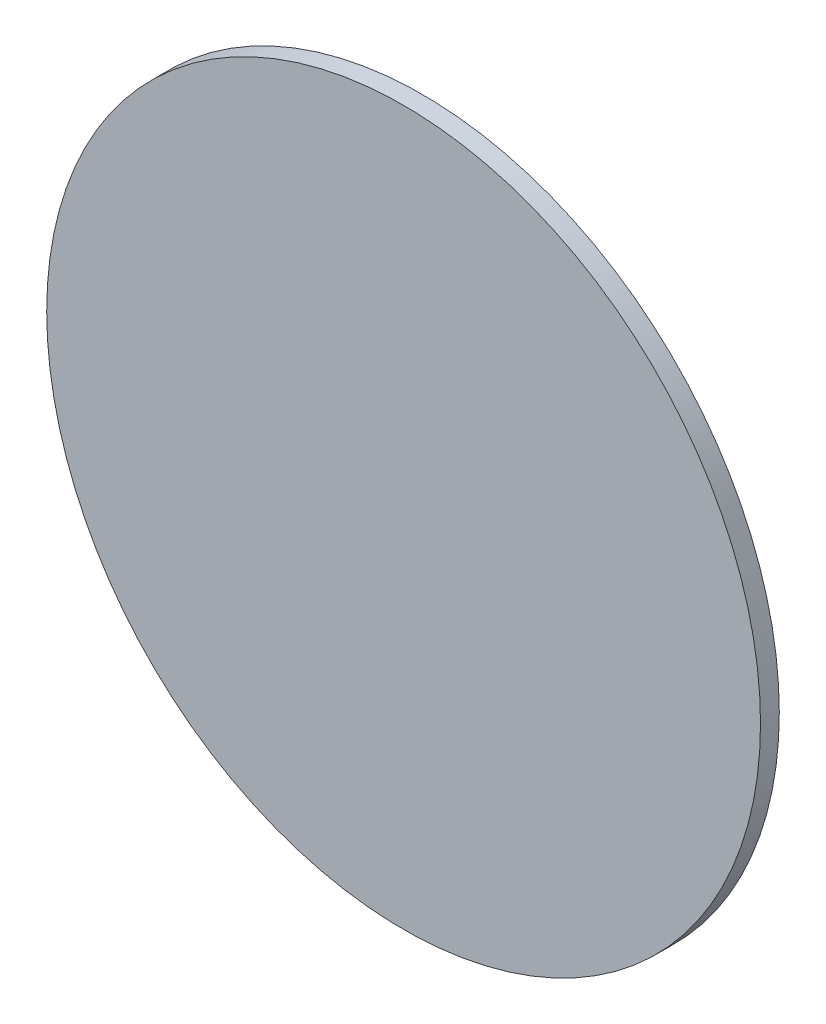
ISO-10303-21;
HEADER;
FILE_DESCRIPTION(('STEP AP214'),'2;1');
FILE_NAME('part.step','',(''),(''),'','','');
FILE_SCHEMA(('AUTOMOTIVE_DESIGN { 1 0 10303 214 1 1 1 1 }'));
ENDSEC;
DATA;
#1=APPLICATION_CONTEXT('core data for automotive mechanical design processes');
#2=APPLICATION_PROTOCOL_DEFINITION('international standard','automotive_design',2000,#1);
#3=PRODUCT_CONTEXT('',#1,'mechanical');
#4=PRODUCT('Part','Part','',(#3));
#5=PRODUCT_RELATED_PRODUCT_CATEGORY('part','',(#4));
#6=PRODUCT_DEFINITION_FORMATION('','',#4);
#7=PRODUCT_DEFINITION_CONTEXT('part definition',#1,'design');
#8=PRODUCT_DEFINITION('design','',#6,#7);
#9=PRODUCT_DEFINITION_SHAPE('','',#8);
#10=(LENGTH_UNIT() NAMED_UNIT(*) SI_UNIT(.MILLI.,.METRE.));
#11=(NAMED_UNIT(*) PLANE_ANGLE_UNIT() SI_UNIT($,.RADIAN.));
#12=(NAMED_UNIT(*) SI_UNIT($,.STERADIAN.) SOLID_ANGLE_UNIT());
#13=UNCERTAINTY_MEASURE_WITH_UNIT(LENGTH_MEASURE(1.E-05),#10,'distance_accuracy_value','');
#14=(GEOMETRIC_REPRESENTATION_CONTEXT(3) GLOBAL_UNCERTAINTY_ASSIGNED_CONTEXT((#13)) GLOBAL_UNIT_ASSIGNED_CONTEXT((#10,
#11,#12)) REPRESENTATION_CONTEXT('',''));
#15=CARTESIAN_POINT('',(0.,0.,0.));
#16=DIRECTION('',(0.,0.,1.));
#17=DIRECTION('',(1.,0.,0.));
#18=AXIS2_PLACEMENT_3D('',#15,#16,#17);
#19=CARTESIAN_POINT('',(0.,0.,1.));
#20=DIRECTION('',(0.,0.,-1.));
#21=DIRECTION('',(-1.,0.,0.));
#22=AXIS2_PLACEMENT_3D('',#19,#20,#21);
#23=CYLINDRICAL_SURFACE('',#22,19.);
#24=CARTESIAN_POINT('',(0.,0.,1.));
#25=DIRECTION('',(0.,0.,1.));
#26=DIRECTION('',(1.,0.,0.));
#27=AXIS2_PLACEMENT_3D('',#24,#25,#26);
#28=CIRCLE('',#27,19.);
#29=CARTESIAN_POINT('',(19.,0.,1.));
#30=VERTEX_POINT('',#29);
#31=EDGE_CURVE('E10',#30,#30,#28,.T.);
#32=ORIENTED_EDGE('',*,*,#31,.F.);
#33=EDGE_LOOP('',(#32));
#34=FACE_BOUND('',#33,.T.);
#35=CARTESIAN_POINT('',(0.,0.,0.));
#36=DIRECTION('',(0.,0.,1.));
#37=DIRECTION('',(1.,0.,0.));
#38=AXIS2_PLACEMENT_3D('',#35,#36,#37);
#39=CIRCLE('',#38,19.);
#40=CARTESIAN_POINT('',(19.,0.,0.));
#41=VERTEX_POINT('',#40);
#42=EDGE_CURVE('E37',#41,#41,#39,.T.);
#43=ORIENTED_EDGE('',*,*,#42,.T.);
#44=EDGE_LOOP('',(#43));
#45=FACE_BOUND('',#44,.T.);
#46=ADVANCED_FACE('F34',(#34,#45),#23,.T.);
#47=CARTESIAN_POINT('',(0.,0.,1.));
#48=DIRECTION('',(0.,0.,1.));
#49=DIRECTION('',(1.,0.,0.));
#50=AXIS2_PLACEMENT_3D('',#47,#48,#49);
#51=PLANE('',#50);
#52=ORIENTED_EDGE('',*,*,#31,.T.);
#53=EDGE_LOOP('',(#52));
#54=FACE_BOUND('',#53,.T.);
#55=ADVANCED_FACE('F49',(#54),#51,.T.);
#56=CARTESIAN_POINT('',(0.,0.,0.));
#57=DIRECTION('',(0.,0.,1.));
#58=DIRECTION('',(1.,0.,0.));
#59=AXIS2_PLACEMENT_3D('',#56,#57,#58);
#60=PLANE('',#59);
#61=ORIENTED_EDGE('',*,*,#42,.F.);
#62=EDGE_LOOP('',(#61));
#63=FACE_BOUND('',#62,.T.);
#64=ADVANCED_FACE('F47',(#63),#60,.F.);
#65=CLOSED_SHELL('',(#46,#55,#64));
#66=MANIFOLD_SOLID_BREP('B2',#65);
#67=ADVANCED_BREP_SHAPE_REPRESENTATION('',(#18,#66),#14);
#68=SHAPE_DEFINITION_REPRESENTATION(#9,#67);
ENDSEC;
END-ISO-10303-21;
